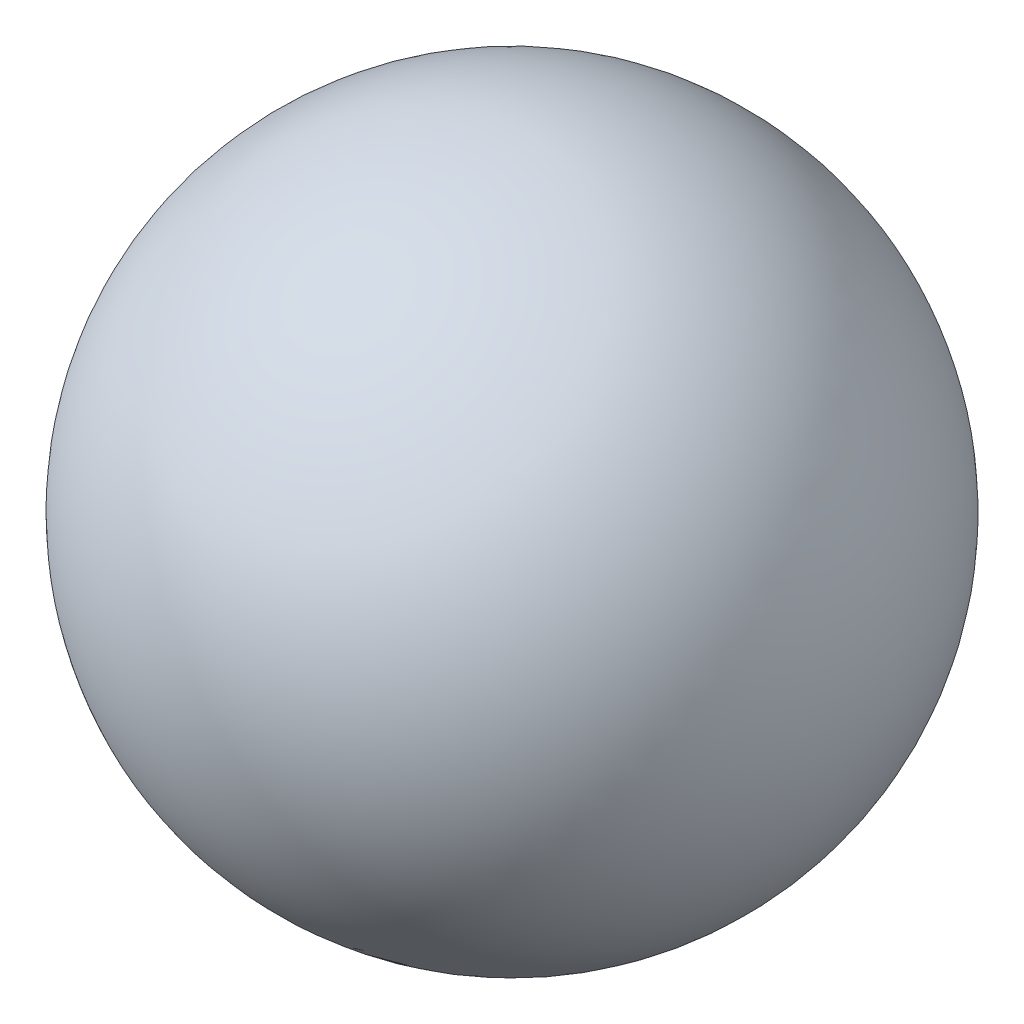
ISO-10303-21;
HEADER;
FILE_DESCRIPTION(('STEP AP214'),'2;1');
FILE_NAME('part.step','',(''),(''),'','','');
FILE_SCHEMA(('AUTOMOTIVE_DESIGN { 1 0 10303 214 1 1 1 1 }'));
ENDSEC;
DATA;
#1=APPLICATION_CONTEXT('core data for automotive mechanical design processes');
#2=APPLICATION_PROTOCOL_DEFINITION('international standard','automotive_design',2000,#1);
#3=PRODUCT_CONTEXT('',#1,'mechanical');
#4=PRODUCT('Part','Part','',(#3));
#5=PRODUCT_RELATED_PRODUCT_CATEGORY('part','',(#4));
#6=PRODUCT_DEFINITION_FORMATION('','',#4);
#7=PRODUCT_DEFINITION_CONTEXT('part definition',#1,'design');
#8=PRODUCT_DEFINITION('design','',#6,#7);
#9=PRODUCT_DEFINITION_SHAPE('','',#8);
#10=(LENGTH_UNIT() NAMED_UNIT(*) SI_UNIT(.MILLI.,.METRE.));
#11=(NAMED_UNIT(*) PLANE_ANGLE_UNIT() SI_UNIT($,.RADIAN.));
#12=(NAMED_UNIT(*) SI_UNIT($,.STERADIAN.) SOLID_ANGLE_UNIT());
#13=UNCERTAINTY_MEASURE_WITH_UNIT(LENGTH_MEASURE(1.E-05),#10,'distance_accuracy_value','');
#14=(GEOMETRIC_REPRESENTATION_CONTEXT(3) GLOBAL_UNCERTAINTY_ASSIGNED_CONTEXT((#13)) GLOBAL_UNIT_ASSIGNED_CONTEXT((#10,
#11,#12)) REPRESENTATION_CONTEXT('',''));
#15=CARTESIAN_POINT('',(0.,0.,0.));
#16=DIRECTION('',(0.,0.,1.));
#17=DIRECTION('',(1.,0.,0.));
#18=AXIS2_PLACEMENT_3D('',#15,#16,#17);
#19=CARTESIAN_POINT('',(64.16,8.84745707434973,68.8165909669866));
#20=DIRECTION('',(0.,0.127516208211661,0.99183648684817));
#21=DIRECTION('',(0.173648177666933,-0.976768261968468,0.125578950481563));
#22=AXIS2_PLACEMENT_3D('',#19,#20,#21);
#23=SPHERICAL_SURFACE('',#22,7.15);
#24=CARTESIAN_POINT('',(64.16,9.7591979630631,75.908221847951));
#25=VERTEX_POINT('',#24);
#26=VERTEX_LOOP('',#25);
#27=FACE_BOUND('',#26,.T.);
#28=CARTESIAN_POINT('',(64.16,7.93571618563635,61.7249600860222));
#29=VERTEX_POINT('',#28);
#30=VERTEX_LOOP('',#29);
#31=FACE_BOUND('',#30,.T.);
#32=ADVANCED_FACE('F16',(#27,#31),#23,.T.);
#33=CLOSED_SHELL('',(#32));
#34=MANIFOLD_SOLID_BREP('B1',#33);
#35=ADVANCED_BREP_SHAPE_REPRESENTATION('',(#18,#34),#14);
#36=SHAPE_DEFINITION_REPRESENTATION(#9,#35);
ENDSEC;
END-ISO-10303-21;
